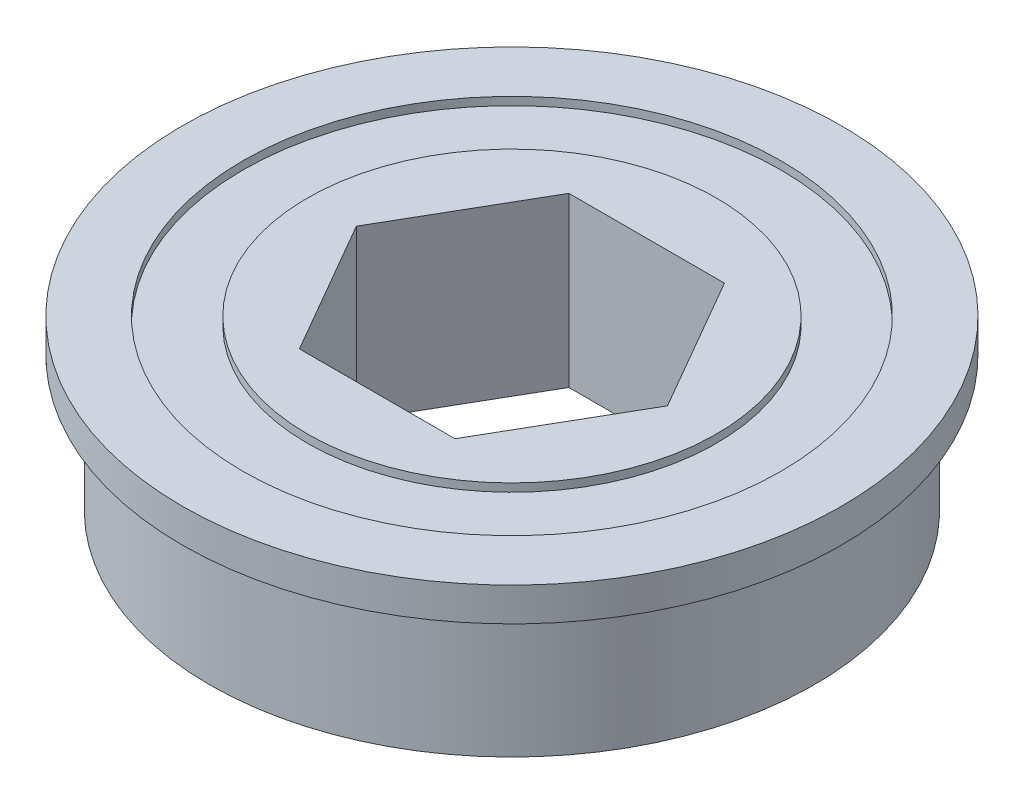
ISO-10303-21;
HEADER;
FILE_DESCRIPTION(('STEP AP214'),'2;1');
FILE_NAME('part.step','',(''),(''),'','','');
FILE_SCHEMA(('AUTOMOTIVE_DESIGN { 1 0 10303 214 1 1 1 1 }'));
ENDSEC;
DATA;
#1=APPLICATION_CONTEXT('core data for automotive mechanical design processes');
#2=APPLICATION_PROTOCOL_DEFINITION('international standard','automotive_design',2000,#1);
#3=PRODUCT_CONTEXT('',#1,'mechanical');
#4=PRODUCT('Part','Part','',(#3));
#5=PRODUCT_RELATED_PRODUCT_CATEGORY('part','',(#4));
#6=PRODUCT_DEFINITION_FORMATION('','',#4);
#7=PRODUCT_DEFINITION_CONTEXT('part definition',#1,'design');
#8=PRODUCT_DEFINITION('design','',#6,#7);
#9=PRODUCT_DEFINITION_SHAPE('','',#8);
#10=(LENGTH_UNIT() NAMED_UNIT(*) SI_UNIT(.MILLI.,.METRE.));
#11=(NAMED_UNIT(*) PLANE_ANGLE_UNIT() SI_UNIT($,.RADIAN.));
#12=(NAMED_UNIT(*) SI_UNIT($,.STERADIAN.) SOLID_ANGLE_UNIT());
#13=UNCERTAINTY_MEASURE_WITH_UNIT(LENGTH_MEASURE(1.E-05),#10,'distance_accuracy_value','');
#14=(GEOMETRIC_REPRESENTATION_CONTEXT(3) GLOBAL_UNCERTAINTY_ASSIGNED_CONTEXT((#13)) GLOBAL_UNIT_ASSIGNED_CONTEXT((#10,
#11,#12)) REPRESENTATION_CONTEXT('',''));
#15=CARTESIAN_POINT('',(0.,0.,0.));
#16=DIRECTION('',(0.,0.,1.));
#17=DIRECTION('',(1.,0.,0.));
#18=AXIS2_PLACEMENT_3D('',#15,#16,#17);
#19=CARTESIAN_POINT('',(0.,0.,0.));
#20=DIRECTION('',(0.,1.,0.));
#21=DIRECTION('',(0.,0.,1.));
#22=AXIS2_PLACEMENT_3D('',#19,#20,#21);
#23=CYLINDRICAL_SURFACE('',#22,12.7);
#24=CARTESIAN_POINT('',(0.,0.381,0.));
#25=DIRECTION('',(0.,1.,0.));
#26=DIRECTION('',(0.,0.,1.));
#27=AXIS2_PLACEMENT_3D('',#24,#25,#26);
#28=CIRCLE('',#27,12.7);
#29=CARTESIAN_POINT('',(0.,0.381,12.7));
#30=VERTEX_POINT('',#29);
#31=EDGE_CURVE('E130',#30,#30,#28,.F.);
#32=ORIENTED_EDGE('',*,*,#31,.F.);
#33=EDGE_LOOP('',(#32));
#34=FACE_BOUND('',#33,.T.);
#35=CARTESIAN_POINT('',(0.,0.,0.));
#36=DIRECTION('',(0.,1.,0.));
#37=DIRECTION('',(0.,0.,1.));
#38=AXIS2_PLACEMENT_3D('',#35,#36,#37);
#39=CIRCLE('',#38,12.7);
#40=CARTESIAN_POINT('',(0.,0.,12.7));
#41=VERTEX_POINT('',#40);
#42=EDGE_CURVE('E127',#41,#41,#39,.T.);
#43=ORIENTED_EDGE('',*,*,#42,.F.);
#44=EDGE_LOOP('',(#43));
#45=FACE_BOUND('',#44,.T.);
#46=ADVANCED_FACE('F18',(#34,#45),#23,.F.);
#47=CARTESIAN_POINT('',(9.652,0.381,0.));
#48=DIRECTION('',(0.,-1.,0.));
#49=DIRECTION('',(0.,0.,-1.));
#50=AXIS2_PLACEMENT_3D('',#47,#48,#49);
#51=PLANE('',#50);
#52=ORIENTED_EDGE('',*,*,#31,.T.);
#53=EDGE_LOOP('',(#52));
#54=FACE_BOUND('',#53,.T.);
#55=CARTESIAN_POINT('',(0.,0.381,0.));
#56=DIRECTION('',(0.,1.,0.));
#57=DIRECTION('',(0.,0.,1.));
#58=AXIS2_PLACEMENT_3D('',#55,#56,#57);
#59=CIRCLE('',#58,9.652);
#60=CARTESIAN_POINT('',(0.,0.381,9.652));
#61=VERTEX_POINT('',#60);
#62=EDGE_CURVE('E124',#61,#61,#59,.F.);
#63=ORIENTED_EDGE('',*,*,#62,.F.);
#64=EDGE_LOOP('',(#63));
#65=FACE_BOUND('',#64,.T.);
#66=ADVANCED_FACE('F359',(#54,#65),#51,.T.);
#67=CARTESIAN_POINT('',(14.2748,0.,0.));
#68=DIRECTION('',(0.,-1.,0.));
#69=DIRECTION('',(0.,0.,-1.));
#70=AXIS2_PLACEMENT_3D('',#67,#68,#69);
#71=PLANE('',#70);
#72=CARTESIAN_POINT('',(0.,0.,0.));
#73=DIRECTION('',(0.,1.,0.));
#74=DIRECTION('',(0.,0.,1.));
#75=AXIS2_PLACEMENT_3D('',#72,#73,#74);
#76=CIRCLE('',#75,14.2748);
#77=CARTESIAN_POINT('',(0.,0.,14.2748));
#78=VERTEX_POINT('',#77);
#79=EDGE_CURVE('E121',#78,#78,#76,.T.);
#80=ORIENTED_EDGE('',*,*,#79,.F.);
#81=EDGE_LOOP('',(#80));
#82=FACE_BOUND('',#81,.T.);
#83=ORIENTED_EDGE('',*,*,#42,.T.);
#84=EDGE_LOOP('',(#83));
#85=FACE_BOUND('',#84,.T.);
#86=ADVANCED_FACE('F349',(#82,#85),#71,.T.);
#87=CARTESIAN_POINT('',(0.,0.,0.));
#88=DIRECTION('',(0.,1.,0.));
#89=DIRECTION('',(0.,0.,1.));
#90=AXIS2_PLACEMENT_3D('',#87,#88,#89);
#91=CYLINDRICAL_SURFACE('',#90,9.652);
#92=CARTESIAN_POINT('',(0.,0.,0.));
#93=DIRECTION('',(0.,1.,0.));
#94=DIRECTION('',(0.,0.,1.));
#95=AXIS2_PLACEMENT_3D('',#92,#93,#94);
#96=CIRCLE('',#95,9.652);
#97=CARTESIAN_POINT('',(0.,0.,9.652));
#98=VERTEX_POINT('',#97);
#99=EDGE_CURVE('E101',#98,#98,#96,.F.);
#100=ORIENTED_EDGE('',*,*,#99,.F.);
#101=EDGE_LOOP('',(#100));
#102=FACE_BOUND('',#101,.T.);
#103=ORIENTED_EDGE('',*,*,#62,.T.);
#104=EDGE_LOOP('',(#103));
#105=FACE_BOUND('',#104,.T.);
#106=ADVANCED_FACE('F339',(#102,#105),#91,.T.);
#107=CARTESIAN_POINT('',(0.,0.,0.));
#108=DIRECTION('',(0.,1.,0.));
#109=DIRECTION('',(0.,0.,1.));
#110=AXIS2_PLACEMENT_3D('',#107,#108,#109);
#111=CYLINDRICAL_SURFACE('',#110,14.2748);
#112=ORIENTED_EDGE('',*,*,#79,.T.);
#113=EDGE_LOOP('',(#112));
#114=FACE_BOUND('',#113,.T.);
#115=CARTESIAN_POINT('',(0.,5.6,0.));
#116=DIRECTION('',(0.,-1.,0.));
#117=DIRECTION('',(0.,0.,-1.));
#118=AXIS2_PLACEMENT_3D('',#115,#116,#117);
#119=CIRCLE('',#118,14.2748);
#120=CARTESIAN_POINT('',(0.,5.6,-14.2748));
#121=VERTEX_POINT('',#120);
#122=EDGE_CURVE('E84',#121,#121,#119,.F.);
#123=ORIENTED_EDGE('',*,*,#122,.F.);
#124=EDGE_LOOP('',(#123));
#125=FACE_BOUND('',#124,.T.);
#126=ADVANCED_FACE('F329',(#114,#125),#111,.T.);
#127=CARTESIAN_POINT('',(9.652,0.,0.));
#128=DIRECTION('',(0.,-1.,0.));
#129=DIRECTION('',(0.,0.,-1.));
#130=AXIS2_PLACEMENT_3D('',#127,#128,#129);
#131=PLANE('',#130);
#132=ORIENTED_EDGE('',*,*,#99,.T.);
#133=EDGE_LOOP('',(#132));
#134=FACE_BOUND('',#133,.T.);
#135=DIRECTION('',(1.,0.,0.));
#136=VECTOR('',#135,1.);
#137=CARTESIAN_POINT('',(-3.67194771204601,0.,6.36));
#138=LINE('',#137,#136);
#139=CARTESIAN_POINT('',(-3.67194771204601,0.,6.36));
#140=VERTEX_POINT('',#139);
#141=CARTESIAN_POINT('',(3.67194771204602,0.,6.36));
#142=VERTEX_POINT('',#141);
#143=EDGE_CURVE('E63',#140,#142,#138,.T.);
#144=ORIENTED_EDGE('',*,*,#143,.T.);
#145=DIRECTION('',(0.5,0.,-0.866025403784439));
#146=VECTOR('',#145,1.);
#147=CARTESIAN_POINT('',(3.67194771204602,0.,6.36));
#148=LINE('',#147,#146);
#149=CARTESIAN_POINT('',(7.34389542409204,0.,0.));
#150=VERTEX_POINT('',#149);
#151=EDGE_CURVE('E65',#142,#150,#148,.T.);
#152=ORIENTED_EDGE('',*,*,#151,.T.);
#153=DIRECTION('',(-0.5,0.,-0.866025403784439));
#154=VECTOR('',#153,1.);
#155=CARTESIAN_POINT('',(7.34389542409204,0.,0.));
#156=LINE('',#155,#154);
#157=CARTESIAN_POINT('',(3.67194771204602,0.,-6.36));
#158=VERTEX_POINT('',#157);
#159=EDGE_CURVE('E68',#150,#158,#156,.T.);
#160=ORIENTED_EDGE('',*,*,#159,.T.);
#161=DIRECTION('',(-1.,0.,0.));
#162=VECTOR('',#161,1.);
#163=CARTESIAN_POINT('',(3.67194771204602,0.,-6.36));
#164=LINE('',#163,#162);
#165=CARTESIAN_POINT('',(-3.67194771204602,0.,-6.36));
#166=VERTEX_POINT('',#165);
#167=EDGE_CURVE('E193',#158,#166,#164,.T.);
#168=ORIENTED_EDGE('',*,*,#167,.T.);
#169=DIRECTION('',(-0.5,0.,0.866025403784439));
#170=VECTOR('',#169,1.);
#171=CARTESIAN_POINT('',(-3.67194771204602,0.,-6.36));
#172=LINE('',#171,#170);
#173=CARTESIAN_POINT('',(-7.34389542409204,0.,0.));
#174=VERTEX_POINT('',#173);
#175=EDGE_CURVE('E199',#166,#174,#172,.T.);
#176=ORIENTED_EDGE('',*,*,#175,.T.);
#177=DIRECTION('',(0.5,0.,0.866025403784439));
#178=VECTOR('',#177,1.);
#179=CARTESIAN_POINT('',(-7.34389542409204,0.,0.));
#180=LINE('',#179,#178);
#181=EDGE_CURVE('E204',#174,#140,#180,.T.);
#182=ORIENTED_EDGE('',*,*,#181,.T.);
#183=EDGE_LOOP('',(#144,#152,#160,#168,#176,#182));
#184=FACE_BOUND('',#183,.T.);
#185=ADVANCED_FACE('F67',(#134,#184),#131,.T.);
#186=CARTESIAN_POINT('',(0.,5.6,0.));
#187=DIRECTION('',(0.,-1.,0.));
#188=DIRECTION('',(0.,0.,-1.));
#189=AXIS2_PLACEMENT_3D('',#186,#187,#188);
#190=CONICAL_SURFACE('',#189,14.2748,0.523598775598298);
#191=CARTESIAN_POINT('',(0.,5.975,0.));
#192=DIRECTION('',(0.,1.,0.));
#193=DIRECTION('',(0.,0.,1.));
#194=AXIS2_PLACEMENT_3D('',#191,#192,#193);
#195=CIRCLE('',#194,14.0582936490539);
#196=CARTESIAN_POINT('',(0.,5.975,14.0582936490539));
#197=VERTEX_POINT('',#196);
#198=EDGE_CURVE('E95',#197,#197,#195,.F.);
#199=ORIENTED_EDGE('',*,*,#198,.T.);
#200=EDGE_LOOP('',(#199));
#201=FACE_BOUND('',#200,.T.);
#202=ORIENTED_EDGE('',*,*,#122,.T.);
#203=EDGE_LOOP('',(#202));
#204=FACE_BOUND('',#203,.T.);
#205=ADVANCED_FACE('F311',(#201,#204),#190,.T.);
#206=CARTESIAN_POINT('',(7.34389542409204,0.,0.));
#207=DIRECTION('',(0.866025403784439,0.,-0.5));
#208=DIRECTION('',(-0.5,0.,-0.866025403784439));
#209=AXIS2_PLACEMENT_3D('',#206,#207,#208);
#210=PLANE('',#209);
#211=DIRECTION('',(0.,1.,0.));
#212=VECTOR('',#211,1.);
#213=CARTESIAN_POINT('',(3.67194771204602,0.,-6.36));
#214=LINE('',#213,#212);
#215=CARTESIAN_POINT('',(3.67194771204602,7.9375,-6.36));
#216=VERTEX_POINT('',#215);
#217=EDGE_CURVE('E82',#216,#158,#214,.F.);
#218=ORIENTED_EDGE('',*,*,#217,.T.);
#219=ORIENTED_EDGE('',*,*,#159,.F.);
#220=DIRECTION('',(0.,1.,0.));
#221=VECTOR('',#220,1.);
#222=CARTESIAN_POINT('',(7.34389542409204,0.,0.));
#223=LINE('',#222,#221);
#224=CARTESIAN_POINT('',(7.34389542409204,7.9375,0.));
#225=VERTEX_POINT('',#224);
#226=EDGE_CURVE('E74',#150,#225,#223,.T.);
#227=ORIENTED_EDGE('',*,*,#226,.T.);
#228=DIRECTION('',(0.5,0.,0.866025403784438));
#229=VECTOR('',#228,1.);
#230=CARTESIAN_POINT('',(3.67194771204602,7.9375,-6.36));
#231=LINE('',#230,#229);
#232=EDGE_CURVE('E98',#216,#225,#231,.T.);
#233=ORIENTED_EDGE('',*,*,#232,.F.);
#234=EDGE_LOOP('',(#218,#219,#227,#233));
#235=FACE_BOUND('',#234,.T.);
#236=ADVANCED_FACE('F78',(#235),#210,.F.);
#237=CARTESIAN_POINT('',(3.67194771204602,0.,6.36));
#238=DIRECTION('',(0.866025403784439,0.,0.5));
#239=DIRECTION('',(0.5,0.,-0.866025403784439));
#240=AXIS2_PLACEMENT_3D('',#237,#238,#239);
#241=PLANE('',#240);
#242=ORIENTED_EDGE('',*,*,#226,.F.);
#243=ORIENTED_EDGE('',*,*,#151,.F.);
#244=DIRECTION('',(0.,1.,0.));
#245=VECTOR('',#244,1.);
#246=CARTESIAN_POINT('',(3.67194771204602,0.,6.36));
#247=LINE('',#246,#245);
#248=CARTESIAN_POINT('',(3.67194771204602,7.9375,6.36));
#249=VERTEX_POINT('',#248);
#250=EDGE_CURVE('E91',#142,#249,#247,.T.);
#251=ORIENTED_EDGE('',*,*,#250,.T.);
#252=DIRECTION('',(-0.5,0.,0.866025403784439));
#253=VECTOR('',#252,1.);
#254=CARTESIAN_POINT('',(7.34389542409204,7.9375,0.));
#255=LINE('',#254,#253);
#256=EDGE_CURVE('E88',#225,#249,#255,.T.);
#257=ORIENTED_EDGE('',*,*,#256,.F.);
#258=EDGE_LOOP('',(#242,#243,#251,#257));
#259=FACE_BOUND('',#258,.T.);
#260=ADVANCED_FACE('F86',(#259),#241,.F.);
#261=CARTESIAN_POINT('',(-3.67194771204601,0.,6.36));
#262=DIRECTION('',(0.,0.,1.));
#263=DIRECTION('',(1.,0.,0.));
#264=AXIS2_PLACEMENT_3D('',#261,#262,#263);
#265=PLANE('',#264);
#266=ORIENTED_EDGE('',*,*,#250,.F.);
#267=ORIENTED_EDGE('',*,*,#143,.F.);
#268=DIRECTION('',(0.,1.,0.));
#269=VECTOR('',#268,1.);
#270=CARTESIAN_POINT('',(-3.67194771204601,0.,6.36));
#271=LINE('',#270,#269);
#272=CARTESIAN_POINT('',(-3.67194771204601,7.9375,6.36));
#273=VERTEX_POINT('',#272);
#274=EDGE_CURVE('E201',#140,#273,#271,.T.);
#275=ORIENTED_EDGE('',*,*,#274,.T.);
#276=DIRECTION('',(1.,0.,0.));
#277=VECTOR('',#276,1.);
#278=CARTESIAN_POINT('',(6.35,7.9375,6.36));
#279=LINE('',#278,#277);
#280=EDGE_CURVE('E186',#249,#273,#279,.F.);
#281=ORIENTED_EDGE('',*,*,#280,.F.);
#282=EDGE_LOOP('',(#266,#267,#275,#281));
#283=FACE_BOUND('',#282,.T.);
#284=ADVANCED_FACE('F210',(#283),#265,.F.);
#285=CARTESIAN_POINT('',(-7.34389542409204,0.,0.));
#286=DIRECTION('',(-0.866025403784439,0.,0.5));
#287=DIRECTION('',(0.5,0.,0.866025403784439));
#288=AXIS2_PLACEMENT_3D('',#285,#286,#287);
#289=PLANE('',#288);
#290=ORIENTED_EDGE('',*,*,#274,.F.);
#291=ORIENTED_EDGE('',*,*,#181,.F.);
#292=DIRECTION('',(0.,1.,0.));
#293=VECTOR('',#292,1.);
#294=CARTESIAN_POINT('',(-7.34389542409204,0.,0.));
#295=LINE('',#294,#293);
#296=CARTESIAN_POINT('',(-7.34389542409204,7.9375,0.));
#297=VERTEX_POINT('',#296);
#298=EDGE_CURVE('E196',#174,#297,#295,.T.);
#299=ORIENTED_EDGE('',*,*,#298,.T.);
#300=DIRECTION('',(-0.5,0.,-0.866025403784439));
#301=VECTOR('',#300,1.);
#302=CARTESIAN_POINT('',(-3.67194771204601,7.9375,6.36));
#303=LINE('',#302,#301);
#304=EDGE_CURVE('E183',#273,#297,#303,.T.);
#305=ORIENTED_EDGE('',*,*,#304,.F.);
#306=EDGE_LOOP('',(#290,#291,#299,#305));
#307=FACE_BOUND('',#306,.T.);
#308=ADVANCED_FACE('F226',(#307),#289,.F.);
#309=CARTESIAN_POINT('',(-3.67194771204602,0.,-6.36));
#310=DIRECTION('',(-0.866025403784439,0.,-0.5));
#311=DIRECTION('',(-0.5,0.,0.866025403784439));
#312=AXIS2_PLACEMENT_3D('',#309,#310,#311);
#313=PLANE('',#312);
#314=ORIENTED_EDGE('',*,*,#298,.F.);
#315=ORIENTED_EDGE('',*,*,#175,.F.);
#316=DIRECTION('',(0.,1.,0.));
#317=VECTOR('',#316,1.);
#318=CARTESIAN_POINT('',(-3.67194771204602,0.,-6.36));
#319=LINE('',#318,#317);
#320=CARTESIAN_POINT('',(-3.67194771204602,7.9375,-6.36));
#321=VERTEX_POINT('',#320);
#322=EDGE_CURVE('E99',#166,#321,#319,.T.);
#323=ORIENTED_EDGE('',*,*,#322,.T.);
#324=DIRECTION('',(0.5,0.,-0.866025403784439));
#325=VECTOR('',#324,1.);
#326=CARTESIAN_POINT('',(-7.34389542409204,7.9375,0.));
#327=LINE('',#326,#325);
#328=EDGE_CURVE('E180',#297,#321,#327,.T.);
#329=ORIENTED_EDGE('',*,*,#328,.F.);
#330=EDGE_LOOP('',(#314,#315,#323,#329));
#331=FACE_BOUND('',#330,.T.);
#332=ADVANCED_FACE('F222',(#331),#313,.F.);
#333=CARTESIAN_POINT('',(3.67194771204602,0.,-6.36));
#334=DIRECTION('',(0.,0.,-1.));
#335=DIRECTION('',(-1.,0.,0.));
#336=AXIS2_PLACEMENT_3D('',#333,#334,#335);
#337=PLANE('',#336);
#338=ORIENTED_EDGE('',*,*,#322,.F.);
#339=ORIENTED_EDGE('',*,*,#167,.F.);
#340=ORIENTED_EDGE('',*,*,#217,.F.);
#341=DIRECTION('',(1.,0.,0.));
#342=VECTOR('',#341,1.);
#343=CARTESIAN_POINT('',(6.35,7.9375,-6.36));
#344=LINE('',#343,#342);
#345=EDGE_CURVE('E118',#321,#216,#344,.T.);
#346=ORIENTED_EDGE('',*,*,#345,.F.);
#347=EDGE_LOOP('',(#338,#339,#340,#346));
#348=FACE_BOUND('',#347,.T.);
#349=ADVANCED_FACE('F217',(#348),#337,.F.);
#350=CARTESIAN_POINT('',(6.35,7.9375,0.));
#351=DIRECTION('',(0.,1.,0.));
#352=DIRECTION('',(0.,0.,1.));
#353=AXIS2_PLACEMENT_3D('',#350,#351,#352);
#354=PLANE('',#353);
#355=CARTESIAN_POINT('',(0.,7.9375,0.));
#356=DIRECTION('',(0.,1.,0.));
#357=DIRECTION('',(0.,0.,1.));
#358=AXIS2_PLACEMENT_3D('',#355,#356,#357);
#359=CIRCLE('',#358,9.652);
#360=CARTESIAN_POINT('',(0.,7.9375,9.652));
#361=VERTEX_POINT('',#360);
#362=EDGE_CURVE('E114',#361,#361,#359,.F.);
#363=ORIENTED_EDGE('',*,*,#362,.F.);
#364=EDGE_LOOP('',(#363));
#365=FACE_BOUND('',#364,.T.);
#366=ORIENTED_EDGE('',*,*,#328,.T.);
#367=ORIENTED_EDGE('',*,*,#345,.T.);
#368=ORIENTED_EDGE('',*,*,#232,.T.);
#369=ORIENTED_EDGE('',*,*,#256,.T.);
#370=ORIENTED_EDGE('',*,*,#280,.T.);
#371=ORIENTED_EDGE('',*,*,#304,.T.);
#372=EDGE_LOOP('',(#366,#367,#368,#369,#370,#371));
#373=FACE_BOUND('',#372,.T.);
#374=ADVANCED_FACE('F165',(#365,#373),#354,.T.);
#375=CARTESIAN_POINT('',(0.,6.1,0.));
#376=DIRECTION('',(0.,1.,0.));
#377=DIRECTION('',(0.,0.,1.));
#378=AXIS2_PLACEMENT_3D('',#375,#376,#377);
#379=TOROIDAL_SURFACE('',#378,14.2748,0.25);
#380=ORIENTED_EDGE('',*,*,#198,.F.);
#381=EDGE_LOOP('',(#380));
#382=FACE_BOUND('',#381,.T.);
#383=CARTESIAN_POINT('',(0.,6.35,0.));
#384=DIRECTION('',(0.,-1.,0.));
#385=DIRECTION('',(0.,0.,-1.));
#386=AXIS2_PLACEMENT_3D('',#383,#384,#385);
#387=CIRCLE('',#386,14.2748);
#388=CARTESIAN_POINT('',(0.,6.35,14.2748));
#389=VERTEX_POINT('',#388);
#390=CARTESIAN_POINT('',(0.,6.35,-14.2748));
#391=VERTEX_POINT('',#390);
#392=EDGE_CURVE('E117',#389,#391,#387,.F.);
#393=ORIENTED_EDGE('',*,*,#392,.F.);
#394=CARTESIAN_POINT('',(0.,6.35,0.));
#395=DIRECTION('',(0.,-1.,0.));
#396=DIRECTION('',(0.,0.,1.));
#397=AXIS2_PLACEMENT_3D('',#394,#395,#396);
#398=CIRCLE('',#397,14.2748);
#399=EDGE_CURVE('E37',#391,#389,#398,.F.);
#400=ORIENTED_EDGE('',*,*,#399,.F.);
#401=EDGE_LOOP('',(#393,#400));
#402=FACE_BOUND('',#401,.T.);
#403=ADVANCED_FACE('F132',(#382,#402),#379,.F.);
#404=CARTESIAN_POINT('',(0.,0.,0.));
#405=DIRECTION('',(0.,1.,0.));
#406=DIRECTION('',(0.,0.,1.));
#407=AXIS2_PLACEMENT_3D('',#404,#405,#406);
#408=CYLINDRICAL_SURFACE('',#407,9.652);
#409=CARTESIAN_POINT('',(0.,7.5565,0.));
#410=DIRECTION('',(0.,1.,0.));
#411=DIRECTION('',(0.,0.,1.));
#412=AXIS2_PLACEMENT_3D('',#409,#410,#411);
#413=CIRCLE('',#412,9.652);
#414=CARTESIAN_POINT('',(0.,7.5565,9.652));
#415=VERTEX_POINT('',#414);
#416=EDGE_CURVE('E111',#415,#415,#413,.F.);
#417=ORIENTED_EDGE('',*,*,#416,.F.);
#418=EDGE_LOOP('',(#417));
#419=FACE_BOUND('',#418,.T.);
#420=ORIENTED_EDGE('',*,*,#362,.T.);
#421=EDGE_LOOP('',(#420));
#422=FACE_BOUND('',#421,.T.);
#423=ADVANCED_FACE('F156',(#419,#422),#408,.T.);
#424=CARTESIAN_POINT('',(15.5575,6.35,0.));
#425=DIRECTION('',(0.,-1.,0.));
#426=DIRECTION('',(0.,0.,-1.));
#427=AXIS2_PLACEMENT_3D('',#424,#425,#426);
#428=PLANE('',#427);
#429=CARTESIAN_POINT('',(0.,6.35,0.));
#430=DIRECTION('',(0.,1.,0.));
#431=DIRECTION('',(0.,0.,1.));
#432=AXIS2_PLACEMENT_3D('',#429,#430,#431);
#433=CIRCLE('',#432,15.5575);
#434=CARTESIAN_POINT('',(0.,6.35,15.5575));
#435=VERTEX_POINT('',#434);
#436=EDGE_CURVE('E108',#435,#435,#433,.T.);
#437=ORIENTED_EDGE('',*,*,#436,.F.);
#438=EDGE_LOOP('',(#437));
#439=FACE_BOUND('',#438,.T.);
#440=ORIENTED_EDGE('',*,*,#392,.T.);
#441=ORIENTED_EDGE('',*,*,#399,.T.);
#442=EDGE_LOOP('',(#440,#441));
#443=FACE_BOUND('',#442,.T.);
#444=ADVANCED_FACE('F136',(#439,#443),#428,.T.);
#445=CARTESIAN_POINT('',(9.652,7.5565,0.));
#446=DIRECTION('',(0.,1.,0.));
#447=DIRECTION('',(0.,0.,1.));
#448=AXIS2_PLACEMENT_3D('',#445,#446,#447);
#449=PLANE('',#448);
#450=ORIENTED_EDGE('',*,*,#416,.T.);
#451=EDGE_LOOP('',(#450));
#452=FACE_BOUND('',#451,.T.);
#453=CARTESIAN_POINT('',(0.,7.5565,0.));
#454=DIRECTION('',(0.,1.,0.));
#455=DIRECTION('',(0.,0.,1.));
#456=AXIS2_PLACEMENT_3D('',#453,#454,#455);
#457=CIRCLE('',#456,12.7);
#458=CARTESIAN_POINT('',(0.,7.5565,12.7));
#459=VERTEX_POINT('',#458);
#460=EDGE_CURVE('E105',#459,#459,#457,.T.);
#461=ORIENTED_EDGE('',*,*,#460,.T.);
#462=EDGE_LOOP('',(#461));
#463=FACE_BOUND('',#462,.T.);
#464=ADVANCED_FACE('F155',(#452,#463),#449,.T.);
#465=CARTESIAN_POINT('',(0.,0.,0.));
#466=DIRECTION('',(0.,1.,0.));
#467=DIRECTION('',(0.,0.,1.));
#468=AXIS2_PLACEMENT_3D('',#465,#466,#467);
#469=CYLINDRICAL_SURFACE('',#468,15.5575);
#470=ORIENTED_EDGE('',*,*,#436,.T.);
#471=EDGE_LOOP('',(#470));
#472=FACE_BOUND('',#471,.T.);
#473=CARTESIAN_POINT('',(0.,7.9375,0.));
#474=DIRECTION('',(0.,1.,0.));
#475=DIRECTION('',(0.,0.,1.));
#476=AXIS2_PLACEMENT_3D('',#473,#474,#475);
#477=CIRCLE('',#476,15.5575);
#478=CARTESIAN_POINT('',(0.,7.9375,15.5575));
#479=VERTEX_POINT('',#478);
#480=EDGE_CURVE('E29',#479,#479,#477,.T.);
#481=ORIENTED_EDGE('',*,*,#480,.F.);
#482=EDGE_LOOP('',(#481));
#483=FACE_BOUND('',#482,.T.);
#484=ADVANCED_FACE('F247',(#472,#483),#469,.T.);
#485=CARTESIAN_POINT('',(0.,0.,0.));
#486=DIRECTION('',(0.,1.,0.));
#487=DIRECTION('',(0.,0.,1.));
#488=AXIS2_PLACEMENT_3D('',#485,#486,#487);
#489=CYLINDRICAL_SURFACE('',#488,12.7);
#490=CARTESIAN_POINT('',(0.,7.9375,0.));
#491=DIRECTION('',(0.,1.,0.));
#492=DIRECTION('',(0.,0.,1.));
#493=AXIS2_PLACEMENT_3D('',#490,#491,#492);
#494=CIRCLE('',#493,12.7);
#495=CARTESIAN_POINT('',(0.,7.9375,12.7));
#496=VERTEX_POINT('',#495);
#497=EDGE_CURVE('E11',#496,#496,#494,.F.);
#498=ORIENTED_EDGE('',*,*,#497,.F.);
#499=EDGE_LOOP('',(#498));
#500=FACE_BOUND('',#499,.T.);
#501=ORIENTED_EDGE('',*,*,#460,.F.);
#502=EDGE_LOOP('',(#501));
#503=FACE_BOUND('',#502,.T.);
#504=ADVANCED_FACE('F241',(#500,#503),#489,.F.);
#505=CARTESIAN_POINT('',(12.7,7.9375,0.));
#506=DIRECTION('',(0.,1.,0.));
#507=DIRECTION('',(0.,0.,1.));
#508=AXIS2_PLACEMENT_3D('',#505,#506,#507);
#509=PLANE('',#508);
#510=ORIENTED_EDGE('',*,*,#497,.T.);
#511=EDGE_LOOP('',(#510));
#512=FACE_BOUND('',#511,.T.);
#513=ORIENTED_EDGE('',*,*,#480,.T.);
#514=EDGE_LOOP('',(#513));
#515=FACE_BOUND('',#514,.T.);
#516=ADVANCED_FACE('F239',(#512,#515),#509,.T.);
#517=CLOSED_SHELL('',(#46,#66,#86,#106,#126,#185,#205,#236,#260,#284,#308,#332,#349,#374,#403,
#423,#444,#464,#484,#504,#516));
#518=MANIFOLD_SOLID_BREP('B1',#517);
#519=ADVANCED_BREP_SHAPE_REPRESENTATION('',(#18,#518),#14);
#520=SHAPE_DEFINITION_REPRESENTATION(#9,#519);
ENDSEC;
END-ISO-10303-21;
